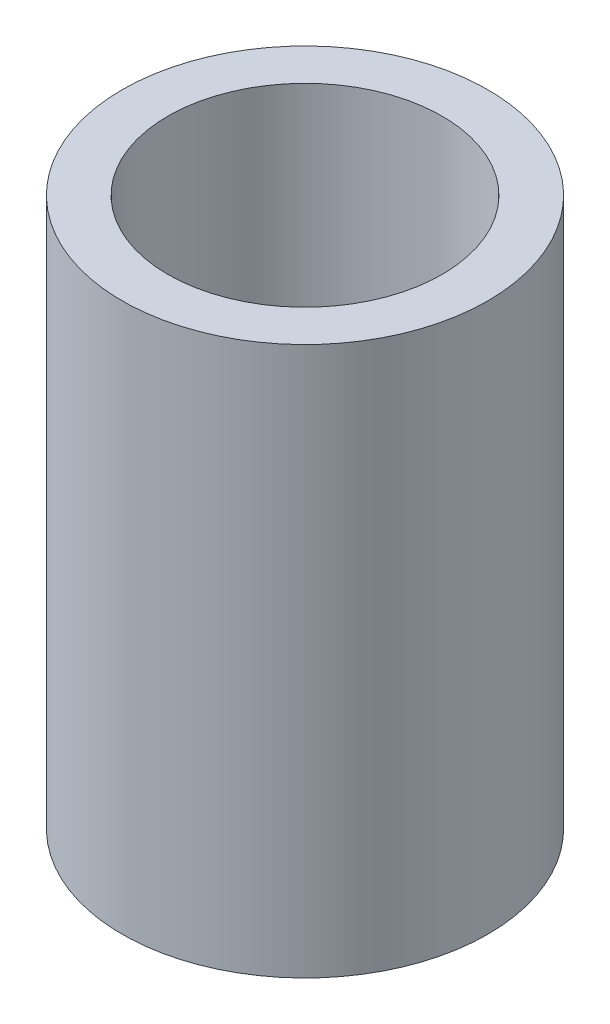
ISO-10303-21;
HEADER;
FILE_DESCRIPTION(('STEP AP214'),'2;1');
FILE_NAME('part.step','',(''),(''),'','','');
FILE_SCHEMA(('AUTOMOTIVE_DESIGN { 1 0 10303 214 1 1 1 1 }'));
ENDSEC;
DATA;
#1=APPLICATION_CONTEXT('core data for automotive mechanical design processes');
#2=APPLICATION_PROTOCOL_DEFINITION('international standard','automotive_design',2000,#1);
#3=PRODUCT_CONTEXT('',#1,'mechanical');
#4=PRODUCT('Part','Part','',(#3));
#5=PRODUCT_RELATED_PRODUCT_CATEGORY('part','',(#4));
#6=PRODUCT_DEFINITION_FORMATION('','',#4);
#7=PRODUCT_DEFINITION_CONTEXT('part definition',#1,'design');
#8=PRODUCT_DEFINITION('design','',#6,#7);
#9=PRODUCT_DEFINITION_SHAPE('','',#8);
#10=(LENGTH_UNIT() NAMED_UNIT(*) SI_UNIT(.MILLI.,.METRE.));
#11=(NAMED_UNIT(*) PLANE_ANGLE_UNIT() SI_UNIT($,.RADIAN.));
#12=(NAMED_UNIT(*) SI_UNIT($,.STERADIAN.) SOLID_ANGLE_UNIT());
#13=UNCERTAINTY_MEASURE_WITH_UNIT(LENGTH_MEASURE(1.E-05),#10,'distance_accuracy_value','');
#14=(GEOMETRIC_REPRESENTATION_CONTEXT(3) GLOBAL_UNCERTAINTY_ASSIGNED_CONTEXT((#13)) GLOBAL_UNIT_ASSIGNED_CONTEXT((#10,
#11,#12)) REPRESENTATION_CONTEXT('',''));
#15=CARTESIAN_POINT('',(0.,0.,0.));
#16=DIRECTION('',(0.,0.,1.));
#17=DIRECTION('',(1.,0.,0.));
#18=AXIS2_PLACEMENT_3D('',#15,#16,#17);
#19=CARTESIAN_POINT('',(0.,12.,0.));
#20=DIRECTION('',(0.,1.,0.));
#21=DIRECTION('',(0.,0.,1.));
#22=AXIS2_PLACEMENT_3D('',#19,#20,#21);
#23=PLANE('',#22);
#24=CARTESIAN_POINT('',(0.,12.,0.));
#25=DIRECTION('',(0.,1.,0.));
#26=DIRECTION('',(1.,0.,0.));
#27=AXIS2_PLACEMENT_3D('',#24,#25,#26);
#28=CIRCLE('',#27,4.);
#29=CARTESIAN_POINT('',(4.,12.,0.));
#30=VERTEX_POINT('',#29);
#31=EDGE_CURVE('E11',#30,#30,#28,.T.);
#32=ORIENTED_EDGE('',*,*,#31,.T.);
#33=EDGE_LOOP('',(#32));
#34=FACE_BOUND('',#33,.T.);
#35=CARTESIAN_POINT('',(0.,12.,0.));
#36=DIRECTION('',(0.,1.,0.));
#37=DIRECTION('',(0.,0.,1.));
#38=AXIS2_PLACEMENT_3D('',#35,#36,#37);
#39=CIRCLE('',#38,3.);
#40=CARTESIAN_POINT('',(0.,12.,3.));
#41=VERTEX_POINT('',#40);
#42=EDGE_CURVE('E52',#41,#41,#39,.T.);
#43=ORIENTED_EDGE('',*,*,#42,.F.);
#44=EDGE_LOOP('',(#43));
#45=FACE_BOUND('',#44,.T.);
#46=ADVANCED_FACE('F41',(#34,#45),#23,.T.);
#47=CARTESIAN_POINT('',(0.,0.,0.));
#48=DIRECTION('',(0.,1.,0.));
#49=DIRECTION('',(0.,0.,1.));
#50=AXIS2_PLACEMENT_3D('',#47,#48,#49);
#51=PLANE('',#50);
#52=CARTESIAN_POINT('',(0.,0.,0.));
#53=DIRECTION('',(0.,1.,0.));
#54=DIRECTION('',(1.,0.,0.));
#55=AXIS2_PLACEMENT_3D('',#52,#53,#54);
#56=CIRCLE('',#55,4.);
#57=CARTESIAN_POINT('',(4.,0.,0.));
#58=VERTEX_POINT('',#57);
#59=EDGE_CURVE('E45',#58,#58,#56,.T.);
#60=ORIENTED_EDGE('',*,*,#59,.F.);
#61=EDGE_LOOP('',(#60));
#62=FACE_BOUND('',#61,.T.);
#63=CARTESIAN_POINT('',(0.,0.,0.));
#64=DIRECTION('',(0.,1.,0.));
#65=DIRECTION('',(0.,0.,1.));
#66=AXIS2_PLACEMENT_3D('',#63,#64,#65);
#67=CIRCLE('',#66,3.);
#68=CARTESIAN_POINT('',(0.,0.,3.));
#69=VERTEX_POINT('',#68);
#70=EDGE_CURVE('E54',#69,#69,#67,.T.);
#71=ORIENTED_EDGE('',*,*,#70,.T.);
#72=EDGE_LOOP('',(#71));
#73=FACE_BOUND('',#72,.T.);
#74=ADVANCED_FACE('F64',(#62,#73),#51,.F.);
#75=CARTESIAN_POINT('',(0.,12.,0.));
#76=DIRECTION('',(0.,-1.,0.));
#77=DIRECTION('',(0.,0.,-1.));
#78=AXIS2_PLACEMENT_3D('',#75,#76,#77);
#79=CYLINDRICAL_SURFACE('',#78,4.);
#80=ORIENTED_EDGE('',*,*,#31,.F.);
#81=EDGE_LOOP('',(#80));
#82=FACE_BOUND('',#81,.T.);
#83=ORIENTED_EDGE('',*,*,#59,.T.);
#84=EDGE_LOOP('',(#83));
#85=FACE_BOUND('',#84,.T.);
#86=ADVANCED_FACE('F43',(#82,#85),#79,.T.);
#87=CARTESIAN_POINT('',(0.,12.,0.));
#88=DIRECTION('',(0.,-1.,0.));
#89=DIRECTION('',(0.,0.,-1.));
#90=AXIS2_PLACEMENT_3D('',#87,#88,#89);
#91=CYLINDRICAL_SURFACE('',#90,3.);
#92=ORIENTED_EDGE('',*,*,#42,.T.);
#93=EDGE_LOOP('',(#92));
#94=FACE_BOUND('',#93,.T.);
#95=ORIENTED_EDGE('',*,*,#70,.F.);
#96=EDGE_LOOP('',(#95));
#97=FACE_BOUND('',#96,.T.);
#98=ADVANCED_FACE('F60',(#94,#97),#91,.F.);
#99=CLOSED_SHELL('',(#46,#74,#86,#98));
#100=MANIFOLD_SOLID_BREP('B2',#99);
#101=ADVANCED_BREP_SHAPE_REPRESENTATION('',(#18,#100),#14);
#102=SHAPE_DEFINITION_REPRESENTATION(#9,#101);
ENDSEC;
END-ISO-10303-21;
